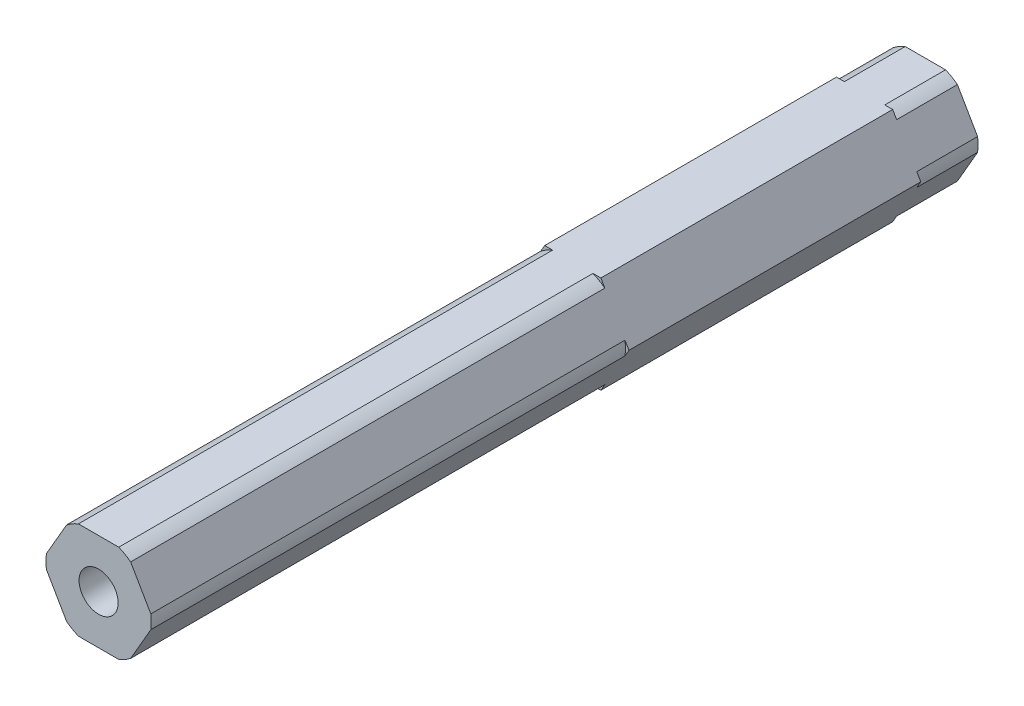
ISO-10303-21;
HEADER;
FILE_DESCRIPTION(('STEP AP214'),'2;1');
FILE_NAME('part.step','',(''),(''),'','','');
FILE_SCHEMA(('AUTOMOTIVE_DESIGN { 1 0 10303 214 1 1 1 1 }'));
ENDSEC;
DATA;
#1=APPLICATION_CONTEXT('core data for automotive mechanical design processes');
#2=APPLICATION_PROTOCOL_DEFINITION('international standard','automotive_design',2000,#1);
#3=PRODUCT_CONTEXT('',#1,'mechanical');
#4=PRODUCT('Part','Part','',(#3));
#5=PRODUCT_RELATED_PRODUCT_CATEGORY('part','',(#4));
#6=PRODUCT_DEFINITION_FORMATION('','',#4);
#7=PRODUCT_DEFINITION_CONTEXT('part definition',#1,'design');
#8=PRODUCT_DEFINITION('design','',#6,#7);
#9=PRODUCT_DEFINITION_SHAPE('','',#8);
#10=(LENGTH_UNIT() NAMED_UNIT(*) SI_UNIT(.MILLI.,.METRE.));
#11=(NAMED_UNIT(*) PLANE_ANGLE_UNIT() SI_UNIT($,.RADIAN.));
#12=(NAMED_UNIT(*) SI_UNIT($,.STERADIAN.) SOLID_ANGLE_UNIT());
#13=UNCERTAINTY_MEASURE_WITH_UNIT(LENGTH_MEASURE(1.E-05),#10,'distance_accuracy_value','');
#14=(GEOMETRIC_REPRESENTATION_CONTEXT(3) GLOBAL_UNCERTAINTY_ASSIGNED_CONTEXT((#13)) GLOBAL_UNIT_ASSIGNED_CONTEXT((#10,
#11,#12)) REPRESENTATION_CONTEXT('',''));
#15=CARTESIAN_POINT('',(0.,0.,0.));
#16=DIRECTION('',(0.,0.,1.));
#17=DIRECTION('',(1.,0.,0.));
#18=AXIS2_PLACEMENT_3D('',#15,#16,#17);
#19=CARTESIAN_POINT('',(0.,0.,-19.05));
#20=DIRECTION('',(0.,0.,1.));
#21=DIRECTION('',(1.,0.,0.));
#22=AXIS2_PLACEMENT_3D('',#19,#20,#21);
#23=PLANE('',#22);
#24=DIRECTION('',(-0.500000000000007,0.866025403784434,0.));
#25=VECTOR('',#24,1.);
#26=CARTESIAN_POINT('',(7.33234841870825,0.,-19.05));
#27=LINE('',#26,#25);
#28=CARTESIAN_POINT('',(4.18177080173133,5.45696050579325,-19.05));
#29=VERTEX_POINT('',#28);
#30=CARTESIAN_POINT('',(3.66617420935407,6.35000000000003,-19.05));
#31=VERTEX_POINT('',#30);
#32=EDGE_CURVE('E464',#29,#31,#27,.T.);
#33=ORIENTED_EDGE('',*,*,#32,.F.);
#34=CARTESIAN_POINT('',(0.,0.,-19.05));
#35=DIRECTION('',(0.,0.,1.));
#36=DIRECTION('',(1.,0.,0.));
#37=AXIS2_PLACEMENT_3D('',#34,#35,#36);
#38=CIRCLE('',#37,6.875);
#39=CARTESIAN_POINT('',(2.63498102459953,6.35000000000003,-19.05));
#40=VERTEX_POINT('',#39);
#41=EDGE_CURVE('E302',#29,#40,#38,.T.);
#42=ORIENTED_EDGE('',*,*,#41,.T.);
#43=DIRECTION('',(-1.,0.,0.));
#44=VECTOR('',#43,1.);
#45=CARTESIAN_POINT('',(3.66617420935407,6.35000000000003,-19.05));
#46=LINE('',#45,#44);
#47=EDGE_CURVE('E469',#31,#40,#46,.T.);
#48=ORIENTED_EDGE('',*,*,#47,.F.);
#49=EDGE_LOOP('',(#33,#42,#48));
#50=FACE_BOUND('',#49,.T.);
#51=ADVANCED_FACE('F37',(#50),#23,.F.);
#52=CARTESIAN_POINT('',(-2.63498102459953,6.35000000000003,-19.05));
#53=VERTEX_POINT('',#52);
#54=CARTESIAN_POINT('',(-3.6661742093542,6.34999999999996,-19.05));
#55=VERTEX_POINT('',#54);
#56=EDGE_CURVE('E468',#53,#55,#46,.T.);
#57=ORIENTED_EDGE('',*,*,#56,.F.);
#58=CARTESIAN_POINT('',(0.,0.,-19.05));
#59=DIRECTION('',(0.,0.,1.));
#60=DIRECTION('',(1.,0.,0.));
#61=AXIS2_PLACEMENT_3D('',#58,#59,#60);
#62=CIRCLE('',#61,6.875);
#63=CARTESIAN_POINT('',(-4.18177080173146,5.45696050579315,-19.05));
#64=VERTEX_POINT('',#63);
#65=EDGE_CURVE('E307',#53,#64,#62,.T.);
#66=ORIENTED_EDGE('',*,*,#65,.T.);
#67=DIRECTION('',(-0.499999999999995,-0.866025403784442,0.));
#68=VECTOR('',#67,1.);
#69=CARTESIAN_POINT('',(-3.6661742093542,6.34999999999996,-19.05));
#70=LINE('',#69,#68);
#71=EDGE_CURVE('E449',#55,#64,#70,.T.);
#72=ORIENTED_EDGE('',*,*,#71,.F.);
#73=EDGE_LOOP('',(#57,#66,#72));
#74=FACE_BOUND('',#73,.T.);
#75=ADVANCED_FACE('F535',(#74),#23,.F.);
#76=CARTESIAN_POINT('',(-6.81675182633099,0.893039494206808,-19.05));
#77=VERTEX_POINT('',#76);
#78=CARTESIAN_POINT('',(-7.33234841870825,0.,-19.05));
#79=VERTEX_POINT('',#78);
#80=EDGE_CURVE('E429',#77,#79,#70,.T.);
#81=ORIENTED_EDGE('',*,*,#80,.F.);
#82=CARTESIAN_POINT('',(0.,0.,-19.05));
#83=DIRECTION('',(0.,0.,1.));
#84=DIRECTION('',(1.,0.,0.));
#85=AXIS2_PLACEMENT_3D('',#82,#83,#84);
#86=CIRCLE('',#85,6.875);
#87=CARTESIAN_POINT('',(-6.81675182633099,-0.893039494206791,-19.05));
#88=VERTEX_POINT('',#87);
#89=EDGE_CURVE('E350',#77,#88,#86,.T.);
#90=ORIENTED_EDGE('',*,*,#89,.T.);
#91=DIRECTION('',(0.500000000000001,-0.866025403784438,0.));
#92=VECTOR('',#91,1.);
#93=CARTESIAN_POINT('',(-7.33234841870825,0.,-19.05));
#94=LINE('',#93,#92);
#95=EDGE_CURVE('E453',#79,#88,#94,.T.);
#96=ORIENTED_EDGE('',*,*,#95,.F.);
#97=EDGE_LOOP('',(#81,#90,#96));
#98=FACE_BOUND('',#97,.T.);
#99=ADVANCED_FACE('F529',(#98),#23,.F.);
#100=CARTESIAN_POINT('',(-4.18177080173137,-5.45696050579322,-19.05));
#101=VERTEX_POINT('',#100);
#102=CARTESIAN_POINT('',(-3.66617420935411,-6.35000000000001,-19.05));
#103=VERTEX_POINT('',#102);
#104=EDGE_CURVE('E452',#101,#103,#94,.T.);
#105=ORIENTED_EDGE('',*,*,#104,.F.);
#106=CARTESIAN_POINT('',(0.,0.,-19.05));
#107=DIRECTION('',(0.,0.,1.));
#108=DIRECTION('',(1.,0.,0.));
#109=AXIS2_PLACEMENT_3D('',#106,#107,#108);
#110=CIRCLE('',#109,6.875);
#111=CARTESIAN_POINT('',(-2.63498102459959,-6.35000000000001,-19.05));
#112=VERTEX_POINT('',#111);
#113=EDGE_CURVE('E347',#101,#112,#110,.T.);
#114=ORIENTED_EDGE('',*,*,#113,.T.);
#115=DIRECTION('',(1.,0.,0.));
#116=VECTOR('',#115,1.);
#117=CARTESIAN_POINT('',(-3.66617420935411,-6.35000000000001,-19.05));
#118=LINE('',#117,#116);
#119=EDGE_CURVE('E457',#103,#112,#118,.T.);
#120=ORIENTED_EDGE('',*,*,#119,.F.);
#121=EDGE_LOOP('',(#105,#114,#120));
#122=FACE_BOUND('',#121,.T.);
#123=ADVANCED_FACE('F492',(#122),#23,.F.);
#124=CARTESIAN_POINT('',(2.63498102459964,-6.34999999999999,-19.05));
#125=VERTEX_POINT('',#124);
#126=CARTESIAN_POINT('',(3.66617420935415,-6.34999999999998,-19.05));
#127=VERTEX_POINT('',#126);
#128=EDGE_CURVE('E456',#125,#127,#118,.T.);
#129=ORIENTED_EDGE('',*,*,#128,.F.);
#130=CARTESIAN_POINT('',(0.,0.,-19.05));
#131=DIRECTION('',(0.,0.,1.));
#132=DIRECTION('',(1.,0.,0.));
#133=AXIS2_PLACEMENT_3D('',#130,#131,#132);
#134=CIRCLE('',#133,6.875);
#135=CARTESIAN_POINT('',(4.1817708017314,-5.45696050579319,-19.05));
#136=VERTEX_POINT('',#135);
#137=EDGE_CURVE('E344',#125,#136,#134,.T.);
#138=ORIENTED_EDGE('',*,*,#137,.T.);
#139=DIRECTION('',(0.499999999999995,0.866025403784442,0.));
#140=VECTOR('',#139,1.);
#141=CARTESIAN_POINT('',(3.66617420935415,-6.34999999999998,-19.05));
#142=LINE('',#141,#140);
#143=EDGE_CURVE('E461',#127,#136,#142,.T.);
#144=ORIENTED_EDGE('',*,*,#143,.F.);
#145=EDGE_LOOP('',(#129,#138,#144));
#146=FACE_BOUND('',#145,.T.);
#147=ADVANCED_FACE('F516',(#146),#23,.F.);
#148=CARTESIAN_POINT('',(0.,0.,19.05));
#149=DIRECTION('',(0.,0.,1.));
#150=DIRECTION('',(1.,0.,0.));
#151=AXIS2_PLACEMENT_3D('',#148,#149,#150);
#152=PLANE('',#151);
#153=CARTESIAN_POINT('',(0.,0.,19.05));
#154=DIRECTION('',(0.,0.,1.));
#155=DIRECTION('',(1.,0.,0.));
#156=AXIS2_PLACEMENT_3D('',#153,#154,#155);
#157=CIRCLE('',#156,6.875);
#158=CARTESIAN_POINT('',(4.18177080173133,5.45696050579325,19.05));
#159=VERTEX_POINT('',#158);
#160=CARTESIAN_POINT('',(2.63498102459955,6.35000000000002,19.05));
#161=VERTEX_POINT('',#160);
#162=EDGE_CURVE('E377',#159,#161,#157,.T.);
#163=ORIENTED_EDGE('',*,*,#162,.F.);
#164=DIRECTION('',(-0.500000000000007,0.866025403784434,0.));
#165=VECTOR('',#164,1.);
#166=CARTESIAN_POINT('',(7.33234841870825,0.,19.05));
#167=LINE('',#166,#165);
#168=CARTESIAN_POINT('',(3.66617420935407,6.35000000000003,19.05));
#169=VERTEX_POINT('',#168);
#170=EDGE_CURVE('E442',#159,#169,#167,.T.);
#171=ORIENTED_EDGE('',*,*,#170,.T.);
#172=DIRECTION('',(-1.,0.,0.));
#173=VECTOR('',#172,1.);
#174=CARTESIAN_POINT('',(3.66617420935407,6.35000000000003,19.05));
#175=LINE('',#174,#173);
#176=EDGE_CURVE('E446',#169,#161,#175,.T.);
#177=ORIENTED_EDGE('',*,*,#176,.T.);
#178=EDGE_LOOP('',(#163,#171,#177));
#179=FACE_BOUND('',#178,.T.);
#180=ADVANCED_FACE('F518',(#179),#152,.T.);
#181=CARTESIAN_POINT('',(0.,0.,19.05));
#182=DIRECTION('',(0.,0.,1.));
#183=DIRECTION('',(1.,0.,0.));
#184=AXIS2_PLACEMENT_3D('',#181,#182,#183);
#185=CIRCLE('',#184,6.875);
#186=CARTESIAN_POINT('',(6.816751826331,-0.893039494206742,19.05));
#187=VERTEX_POINT('',#186);
#188=CARTESIAN_POINT('',(6.81675182633098,0.893039494206836,19.05));
#189=VERTEX_POINT('',#188);
#190=EDGE_CURVE('E390',#187,#189,#185,.T.);
#191=ORIENTED_EDGE('',*,*,#190,.F.);
#192=DIRECTION('',(0.499999999999995,0.866025403784442,0.));
#193=VECTOR('',#192,1.);
#194=CARTESIAN_POINT('',(3.66617420935415,-6.34999999999998,19.05));
#195=LINE('',#194,#193);
#196=CARTESIAN_POINT('',(7.33234841870825,0.,19.05));
#197=VERTEX_POINT('',#196);
#198=EDGE_CURVE('E439',#187,#197,#195,.T.);
#199=ORIENTED_EDGE('',*,*,#198,.T.);
#200=EDGE_CURVE('E443',#197,#189,#167,.T.);
#201=ORIENTED_EDGE('',*,*,#200,.T.);
#202=EDGE_LOOP('',(#191,#199,#201));
#203=FACE_BOUND('',#202,.T.);
#204=ADVANCED_FACE('F525',(#203),#152,.T.);
#205=CARTESIAN_POINT('',(0.,0.,19.05));
#206=DIRECTION('',(0.,0.,1.));
#207=DIRECTION('',(1.,0.,0.));
#208=AXIS2_PLACEMENT_3D('',#205,#206,#207);
#209=CIRCLE('',#208,6.875);
#210=CARTESIAN_POINT('',(2.63498102459964,-6.34999999999999,19.05));
#211=VERTEX_POINT('',#210);
#212=CARTESIAN_POINT('',(4.18177080173141,-5.45696050579319,19.05));
#213=VERTEX_POINT('',#212);
#214=EDGE_CURVE('E387',#211,#213,#209,.T.);
#215=ORIENTED_EDGE('',*,*,#214,.F.);
#216=DIRECTION('',(1.,0.,0.));
#217=VECTOR('',#216,1.);
#218=CARTESIAN_POINT('',(-3.66617420935411,-6.35000000000001,19.05));
#219=LINE('',#218,#217);
#220=CARTESIAN_POINT('',(3.66617420935415,-6.34999999999998,19.05));
#221=VERTEX_POINT('',#220);
#222=EDGE_CURVE('E436',#211,#221,#219,.T.);
#223=ORIENTED_EDGE('',*,*,#222,.T.);
#224=EDGE_CURVE('E440',#221,#213,#195,.T.);
#225=ORIENTED_EDGE('',*,*,#224,.T.);
#226=EDGE_LOOP('',(#215,#223,#225));
#227=FACE_BOUND('',#226,.T.);
#228=ADVANCED_FACE('F602',(#227),#152,.T.);
#229=CARTESIAN_POINT('',(0.,0.,19.05));
#230=DIRECTION('',(0.,0.,1.));
#231=DIRECTION('',(1.,0.,0.));
#232=AXIS2_PLACEMENT_3D('',#229,#230,#231);
#233=CIRCLE('',#232,6.875);
#234=CARTESIAN_POINT('',(-4.18177080173137,-5.45696050579322,19.05));
#235=VERTEX_POINT('',#234);
#236=CARTESIAN_POINT('',(-2.63498102459959,-6.35000000000001,19.05));
#237=VERTEX_POINT('',#236);
#238=EDGE_CURVE('E384',#235,#237,#233,.T.);
#239=ORIENTED_EDGE('',*,*,#238,.F.);
#240=DIRECTION('',(0.500000000000001,-0.866025403784438,0.));
#241=VECTOR('',#240,1.);
#242=CARTESIAN_POINT('',(-7.33234841870825,0.,19.05));
#243=LINE('',#242,#241);
#244=CARTESIAN_POINT('',(-3.66617420935411,-6.35000000000001,19.05));
#245=VERTEX_POINT('',#244);
#246=EDGE_CURVE('E432',#235,#245,#243,.T.);
#247=ORIENTED_EDGE('',*,*,#246,.T.);
#248=EDGE_CURVE('E437',#245,#237,#219,.T.);
#249=ORIENTED_EDGE('',*,*,#248,.T.);
#250=EDGE_LOOP('',(#239,#247,#249));
#251=FACE_BOUND('',#250,.T.);
#252=ADVANCED_FACE('F604',(#251),#152,.T.);
#253=CARTESIAN_POINT('',(0.,0.,19.05));
#254=DIRECTION('',(0.,0.,1.));
#255=DIRECTION('',(1.,0.,0.));
#256=AXIS2_PLACEMENT_3D('',#253,#254,#255);
#257=CIRCLE('',#256,6.875);
#258=CARTESIAN_POINT('',(-6.81675182633099,0.893039494206809,19.05));
#259=VERTEX_POINT('',#258);
#260=CARTESIAN_POINT('',(-6.81675182633099,-0.893039494206789,19.05));
#261=VERTEX_POINT('',#260);
#262=EDGE_CURVE('E381',#259,#261,#257,.T.);
#263=ORIENTED_EDGE('',*,*,#262,.F.);
#264=DIRECTION('',(-0.499999999999995,-0.866025403784442,0.));
#265=VECTOR('',#264,1.);
#266=CARTESIAN_POINT('',(-3.6661742093542,6.34999999999996,19.05));
#267=LINE('',#266,#265);
#268=CARTESIAN_POINT('',(-7.33234841870825,0.,19.05));
#269=VERTEX_POINT('',#268);
#270=EDGE_CURVE('E433',#259,#269,#267,.T.);
#271=ORIENTED_EDGE('',*,*,#270,.T.);
#272=EDGE_CURVE('E434',#269,#261,#243,.T.);
#273=ORIENTED_EDGE('',*,*,#272,.T.);
#274=EDGE_LOOP('',(#263,#271,#273));
#275=FACE_BOUND('',#274,.T.);
#276=ADVANCED_FACE('F609',(#275),#152,.T.);
#277=CARTESIAN_POINT('',(-3.6661742093542,6.34999999999996,19.05));
#278=DIRECTION('',(0.866025403784442,-0.499999999999995,0.));
#279=DIRECTION('',(0.499999999999995,0.866025403784442,0.));
#280=AXIS2_PLACEMENT_3D('',#277,#278,#279);
#281=PLANE('',#280);
#282=ORIENTED_EDGE('',*,*,#71,.T.);
#283=DIRECTION('',(0.,0.,1.));
#284=VECTOR('',#283,1.);
#285=CARTESIAN_POINT('',(-4.18177080173146,5.45696050579315,-26.9875));
#286=LINE('',#285,#284);
#287=CARTESIAN_POINT('',(-4.18177080173146,5.45696050579315,-26.9875));
#288=VERTEX_POINT('',#287);
#289=EDGE_CURVE('E358',#288,#64,#286,.T.);
#290=ORIENTED_EDGE('',*,*,#289,.F.);
#291=DIRECTION('',(-0.499999999999995,-0.866025403784442,0.));
#292=VECTOR('',#291,1.);
#293=CARTESIAN_POINT('',(-4.18177080173146,5.45696050579315,-26.9875));
#294=LINE('',#293,#292);
#295=CARTESIAN_POINT('',(-6.81675182633099,0.893039494206808,-26.9875));
#296=VERTEX_POINT('',#295);
#297=EDGE_CURVE('E330',#288,#296,#294,.T.);
#298=ORIENTED_EDGE('',*,*,#297,.T.);
#299=DIRECTION('',(0.,0.,1.));
#300=VECTOR('',#299,1.);
#301=CARTESIAN_POINT('',(-6.81675182633099,0.893039494206808,-26.9875));
#302=LINE('',#301,#300);
#303=EDGE_CURVE('E360',#296,#77,#302,.T.);
#304=ORIENTED_EDGE('',*,*,#303,.T.);
#305=ORIENTED_EDGE('',*,*,#80,.T.);
#306=DIRECTION('',(0.,0.,-1.));
#307=VECTOR('',#306,1.);
#308=CARTESIAN_POINT('',(-7.33234841870825,0.,19.05));
#309=LINE('',#308,#307);
#310=EDGE_CURVE('E11',#269,#79,#309,.T.);
#311=ORIENTED_EDGE('',*,*,#310,.F.);
#312=ORIENTED_EDGE('',*,*,#270,.F.);
#313=DIRECTION('',(0.,0.,-1.));
#314=VECTOR('',#313,1.);
#315=CARTESIAN_POINT('',(-6.81675182633099,0.893039494206808,26.9875));
#316=LINE('',#315,#314);
#317=CARTESIAN_POINT('',(-6.81675182633099,0.893039494206808,80.9625));
#318=VERTEX_POINT('',#317);
#319=EDGE_CURVE('E417',#318,#259,#316,.T.);
#320=ORIENTED_EDGE('',*,*,#319,.F.);
#321=DIRECTION('',(-0.499999999999995,-0.866025403784442,0.));
#322=VECTOR('',#321,1.);
#323=CARTESIAN_POINT('',(-4.18177080173146,5.45696050579315,80.9625));
#324=LINE('',#323,#322);
#325=CARTESIAN_POINT('',(-4.18177080173146,5.45696050579315,80.9625));
#326=VERTEX_POINT('',#325);
#327=EDGE_CURVE('E275',#326,#318,#324,.T.);
#328=ORIENTED_EDGE('',*,*,#327,.F.);
#329=DIRECTION('',(0.,0.,-1.));
#330=VECTOR('',#329,1.);
#331=CARTESIAN_POINT('',(-4.18177080173146,5.45696050579315,26.9875));
#332=LINE('',#331,#330);
#333=CARTESIAN_POINT('',(-4.18177080173146,5.45696050579315,19.05));
#334=VERTEX_POINT('',#333);
#335=EDGE_CURVE('E420',#326,#334,#332,.T.);
#336=ORIENTED_EDGE('',*,*,#335,.T.);
#337=CARTESIAN_POINT('',(-3.6661742093542,6.34999999999996,19.05));
#338=VERTEX_POINT('',#337);
#339=EDGE_CURVE('E430',#338,#334,#267,.T.);
#340=ORIENTED_EDGE('',*,*,#339,.F.);
#341=DIRECTION('',(0.,0.,-1.));
#342=VECTOR('',#341,1.);
#343=CARTESIAN_POINT('',(-3.6661742093542,6.34999999999996,19.05));
#344=LINE('',#343,#342);
#345=EDGE_CURVE('E448',#338,#55,#344,.T.);
#346=ORIENTED_EDGE('',*,*,#345,.T.);
#347=EDGE_LOOP('',(#282,#290,#298,#304,#305,#311,#312,#320,#328,#336,#340,#346));
#348=FACE_BOUND('',#347,.T.);
#349=ADVANCED_FACE('F39',(#348),#281,.F.);
#350=CARTESIAN_POINT('',(-7.33234841870825,0.,19.05));
#351=DIRECTION('',(0.866025403784438,0.500000000000001,0.));
#352=DIRECTION('',(-0.500000000000001,0.866025403784438,0.));
#353=AXIS2_PLACEMENT_3D('',#350,#351,#352);
#354=PLANE('',#353);
#355=ORIENTED_EDGE('',*,*,#95,.T.);
#356=DIRECTION('',(0.,0.,1.));
#357=VECTOR('',#356,1.);
#358=CARTESIAN_POINT('',(-6.81675182633099,-0.893039494206791,-26.9875));
#359=LINE('',#358,#357);
#360=CARTESIAN_POINT('',(-6.81675182633099,-0.893039494206791,-26.9875));
#361=VERTEX_POINT('',#360);
#362=EDGE_CURVE('E362',#361,#88,#359,.T.);
#363=ORIENTED_EDGE('',*,*,#362,.F.);
#364=DIRECTION('',(0.500000000000001,-0.866025403784438,0.));
#365=VECTOR('',#364,1.);
#366=CARTESIAN_POINT('',(-6.81675182633099,-0.893039494206791,-26.9875));
#367=LINE('',#366,#365);
#368=CARTESIAN_POINT('',(-4.18177080173137,-5.45696050579322,-26.9875));
#369=VERTEX_POINT('',#368);
#370=EDGE_CURVE('E324',#361,#369,#367,.T.);
#371=ORIENTED_EDGE('',*,*,#370,.T.);
#372=DIRECTION('',(0.,0.,1.));
#373=VECTOR('',#372,1.);
#374=CARTESIAN_POINT('',(-4.18177080173137,-5.45696050579322,-26.9875));
#375=LINE('',#374,#373);
#376=EDGE_CURVE('E364',#369,#101,#375,.T.);
#377=ORIENTED_EDGE('',*,*,#376,.T.);
#378=ORIENTED_EDGE('',*,*,#104,.T.);
#379=DIRECTION('',(0.,0.,-1.));
#380=VECTOR('',#379,1.);
#381=CARTESIAN_POINT('',(-3.66617420935411,-6.35000000000001,19.05));
#382=LINE('',#381,#380);
#383=EDGE_CURVE('E45',#245,#103,#382,.T.);
#384=ORIENTED_EDGE('',*,*,#383,.F.);
#385=ORIENTED_EDGE('',*,*,#246,.F.);
#386=DIRECTION('',(0.,0.,-1.));
#387=VECTOR('',#386,1.);
#388=CARTESIAN_POINT('',(-4.18177080173137,-5.45696050579322,26.9875));
#389=LINE('',#388,#387);
#390=CARTESIAN_POINT('',(-4.18177080173137,-5.45696050579322,80.9625));
#391=VERTEX_POINT('',#390);
#392=EDGE_CURVE('E411',#391,#235,#389,.T.);
#393=ORIENTED_EDGE('',*,*,#392,.F.);
#394=DIRECTION('',(0.500000000000001,-0.866025403784438,0.));
#395=VECTOR('',#394,1.);
#396=CARTESIAN_POINT('',(-6.81675182633099,-0.893039494206791,80.9625));
#397=LINE('',#396,#395);
#398=CARTESIAN_POINT('',(-6.81675182633099,-0.893039494206791,80.9625));
#399=VERTEX_POINT('',#398);
#400=EDGE_CURVE('E281',#399,#391,#397,.T.);
#401=ORIENTED_EDGE('',*,*,#400,.F.);
#402=DIRECTION('',(0.,0.,-1.));
#403=VECTOR('',#402,1.);
#404=CARTESIAN_POINT('',(-6.81675182633099,-0.893039494206791,26.9875));
#405=LINE('',#404,#403);
#406=EDGE_CURVE('E414',#399,#261,#405,.T.);
#407=ORIENTED_EDGE('',*,*,#406,.T.);
#408=ORIENTED_EDGE('',*,*,#272,.F.);
#409=ORIENTED_EDGE('',*,*,#310,.T.);
#410=EDGE_LOOP('',(#355,#363,#371,#377,#378,#384,#385,#393,#401,#407,#408,#409));
#411=FACE_BOUND('',#410,.T.);
#412=ADVANCED_FACE('F593',(#411),#354,.F.);
#413=CARTESIAN_POINT('',(-3.66617420935411,-6.35000000000001,19.05));
#414=DIRECTION('',(0.,1.,0.));
#415=DIRECTION('',(-1.,0.,0.));
#416=AXIS2_PLACEMENT_3D('',#413,#414,#415);
#417=PLANE('',#416);
#418=ORIENTED_EDGE('',*,*,#119,.T.);
#419=DIRECTION('',(0.,0.,1.));
#420=VECTOR('',#419,1.);
#421=CARTESIAN_POINT('',(-2.63498102459959,-6.35000000000001,-26.9875));
#422=LINE('',#421,#420);
#423=CARTESIAN_POINT('',(-2.63498102459959,-6.35000000000001,-26.9875));
#424=VERTEX_POINT('',#423);
#425=EDGE_CURVE('E366',#424,#112,#422,.T.);
#426=ORIENTED_EDGE('',*,*,#425,.F.);
#427=DIRECTION('',(1.,0.,0.));
#428=VECTOR('',#427,1.);
#429=CARTESIAN_POINT('',(-2.63498102459959,-6.35000000000001,-26.9875));
#430=LINE('',#429,#428);
#431=CARTESIAN_POINT('',(2.63498102459964,-6.34999999999999,-26.9875));
#432=VERTEX_POINT('',#431);
#433=EDGE_CURVE('E318',#424,#432,#430,.T.);
#434=ORIENTED_EDGE('',*,*,#433,.T.);
#435=DIRECTION('',(0.,0.,1.));
#436=VECTOR('',#435,1.);
#437=CARTESIAN_POINT('',(2.63498102459964,-6.34999999999999,-26.9875));
#438=LINE('',#437,#436);
#439=EDGE_CURVE('E368',#432,#125,#438,.T.);
#440=ORIENTED_EDGE('',*,*,#439,.T.);
#441=ORIENTED_EDGE('',*,*,#128,.T.);
#442=DIRECTION('',(0.,0.,-1.));
#443=VECTOR('',#442,1.);
#444=CARTESIAN_POINT('',(3.66617420935415,-6.34999999999998,19.05));
#445=LINE('',#444,#443);
#446=EDGE_CURVE('E480',#221,#127,#445,.T.);
#447=ORIENTED_EDGE('',*,*,#446,.F.);
#448=ORIENTED_EDGE('',*,*,#222,.F.);
#449=DIRECTION('',(0.,0.,-1.));
#450=VECTOR('',#449,1.);
#451=CARTESIAN_POINT('',(2.63498102459964,-6.34999999999999,26.9875));
#452=LINE('',#451,#450);
#453=CARTESIAN_POINT('',(2.63498102459964,-6.34999999999999,80.9625));
#454=VERTEX_POINT('',#453);
#455=EDGE_CURVE('E405',#454,#211,#452,.T.);
#456=ORIENTED_EDGE('',*,*,#455,.F.);
#457=DIRECTION('',(1.,0.,0.));
#458=VECTOR('',#457,1.);
#459=CARTESIAN_POINT('',(-2.63498102459959,-6.35000000000001,80.9625));
#460=LINE('',#459,#458);
#461=CARTESIAN_POINT('',(-2.63498102459959,-6.35000000000001,80.9625));
#462=VERTEX_POINT('',#461);
#463=EDGE_CURVE('E287',#462,#454,#460,.T.);
#464=ORIENTED_EDGE('',*,*,#463,.F.);
#465=DIRECTION('',(0.,0.,-1.));
#466=VECTOR('',#465,1.);
#467=CARTESIAN_POINT('',(-2.63498102459959,-6.35000000000001,26.9875));
#468=LINE('',#467,#466);
#469=EDGE_CURVE('E408',#462,#237,#468,.T.);
#470=ORIENTED_EDGE('',*,*,#469,.T.);
#471=ORIENTED_EDGE('',*,*,#248,.F.);
#472=ORIENTED_EDGE('',*,*,#383,.T.);
#473=EDGE_LOOP('',(#418,#426,#434,#440,#441,#447,#448,#456,#464,#470,#471,#472));
#474=FACE_BOUND('',#473,.T.);
#475=ADVANCED_FACE('F487',(#474),#417,.F.);
#476=CARTESIAN_POINT('',(3.66617420935415,-6.34999999999998,19.05));
#477=DIRECTION('',(-0.866025403784442,0.499999999999995,0.));
#478=DIRECTION('',(-0.499999999999995,-0.866025403784442,0.));
#479=AXIS2_PLACEMENT_3D('',#476,#477,#478);
#480=PLANE('',#479);
#481=ORIENTED_EDGE('',*,*,#143,.T.);
#482=DIRECTION('',(0.,0.,1.));
#483=VECTOR('',#482,1.);
#484=CARTESIAN_POINT('',(4.1817708017314,-5.45696050579319,-26.9875));
#485=LINE('',#484,#483);
#486=CARTESIAN_POINT('',(4.1817708017314,-5.45696050579319,-26.9875));
#487=VERTEX_POINT('',#486);
#488=EDGE_CURVE('E370',#487,#136,#485,.T.);
#489=ORIENTED_EDGE('',*,*,#488,.F.);
#490=DIRECTION('',(0.499999999999995,0.866025403784441,0.));
#491=VECTOR('',#490,1.);
#492=CARTESIAN_POINT('',(4.1817708017314,-5.45696050579319,-26.9875));
#493=LINE('',#492,#491);
#494=CARTESIAN_POINT('',(6.816751826331,-0.893039494206739,-26.9875));
#495=VERTEX_POINT('',#494);
#496=EDGE_CURVE('E312',#487,#495,#493,.T.);
#497=ORIENTED_EDGE('',*,*,#496,.T.);
#498=DIRECTION('',(0.,0.,1.));
#499=VECTOR('',#498,1.);
#500=CARTESIAN_POINT('',(6.816751826331,-0.893039494206739,-26.9875));
#501=LINE('',#500,#499);
#502=CARTESIAN_POINT('',(6.816751826331,-0.893039494206739,-19.05));
#503=VERTEX_POINT('',#502);
#504=EDGE_CURVE('E372',#495,#503,#501,.T.);
#505=ORIENTED_EDGE('',*,*,#504,.T.);
#506=CARTESIAN_POINT('',(7.33234841870825,0.,-19.05));
#507=VERTEX_POINT('',#506);
#508=EDGE_CURVE('E460',#503,#507,#142,.T.);
#509=ORIENTED_EDGE('',*,*,#508,.T.);
#510=DIRECTION('',(0.,0.,-1.));
#511=VECTOR('',#510,1.);
#512=CARTESIAN_POINT('',(7.33234841870825,0.,19.05));
#513=LINE('',#512,#511);
#514=EDGE_CURVE('E477',#197,#507,#513,.T.);
#515=ORIENTED_EDGE('',*,*,#514,.F.);
#516=ORIENTED_EDGE('',*,*,#198,.F.);
#517=DIRECTION('',(0.,0.,-1.));
#518=VECTOR('',#517,1.);
#519=CARTESIAN_POINT('',(6.816751826331,-0.893039494206739,26.9875));
#520=LINE('',#519,#518);
#521=CARTESIAN_POINT('',(6.816751826331,-0.893039494206739,80.9625));
#522=VERTEX_POINT('',#521);
#523=EDGE_CURVE('E399',#522,#187,#520,.T.);
#524=ORIENTED_EDGE('',*,*,#523,.F.);
#525=DIRECTION('',(0.499999999999995,0.866025403784442,0.));
#526=VECTOR('',#525,1.);
#527=CARTESIAN_POINT('',(4.18177080173141,-5.45696050579319,80.9625));
#528=LINE('',#527,#526);
#529=CARTESIAN_POINT('',(4.18177080173141,-5.45696050579319,80.9625));
#530=VERTEX_POINT('',#529);
#531=EDGE_CURVE('E293',#530,#522,#528,.T.);
#532=ORIENTED_EDGE('',*,*,#531,.F.);
#533=DIRECTION('',(0.,0.,-1.));
#534=VECTOR('',#533,1.);
#535=CARTESIAN_POINT('',(4.1817708017314,-5.45696050579319,26.9875));
#536=LINE('',#535,#534);
#537=EDGE_CURVE('E402',#530,#213,#536,.T.);
#538=ORIENTED_EDGE('',*,*,#537,.T.);
#539=ORIENTED_EDGE('',*,*,#224,.F.);
#540=ORIENTED_EDGE('',*,*,#446,.T.);
#541=EDGE_LOOP('',(#481,#489,#497,#505,#509,#515,#516,#524,#532,#538,#539,#540));
#542=FACE_BOUND('',#541,.T.);
#543=ADVANCED_FACE('F515',(#542),#480,.F.);
#544=CARTESIAN_POINT('',(7.33234841870825,0.,19.05));
#545=DIRECTION('',(-0.866025403784435,-0.500000000000007,0.));
#546=DIRECTION('',(0.500000000000007,-0.866025403784434,0.));
#547=AXIS2_PLACEMENT_3D('',#544,#545,#546);
#548=PLANE('',#547);
#549=CARTESIAN_POINT('',(6.81675182633098,0.893039494206836,-19.05));
#550=VERTEX_POINT('',#549);
#551=EDGE_CURVE('E465',#507,#550,#27,.T.);
#552=ORIENTED_EDGE('',*,*,#551,.T.);
#553=DIRECTION('',(0.,0.,1.));
#554=VECTOR('',#553,1.);
#555=CARTESIAN_POINT('',(6.81675182633098,0.893039494206839,-26.9875));
#556=LINE('',#555,#554);
#557=CARTESIAN_POINT('',(6.81675182633098,0.893039494206839,-26.9875));
#558=VERTEX_POINT('',#557);
#559=EDGE_CURVE('E52',#558,#550,#556,.T.);
#560=ORIENTED_EDGE('',*,*,#559,.F.);
#561=DIRECTION('',(-0.500000000000007,0.866025403784435,0.));
#562=VECTOR('',#561,1.);
#563=CARTESIAN_POINT('',(6.81675182633098,0.893039494206839,-26.9875));
#564=LINE('',#563,#562);
#565=CARTESIAN_POINT('',(4.18177080173133,5.45696050579325,-26.9875));
#566=VERTEX_POINT('',#565);
#567=EDGE_CURVE('E306',#558,#566,#564,.T.);
#568=ORIENTED_EDGE('',*,*,#567,.T.);
#569=DIRECTION('',(0.,0.,1.));
#570=VECTOR('',#569,1.);
#571=CARTESIAN_POINT('',(4.18177080173133,5.45696050579325,-26.9875));
#572=LINE('',#571,#570);
#573=EDGE_CURVE('E375',#566,#29,#572,.T.);
#574=ORIENTED_EDGE('',*,*,#573,.T.);
#575=ORIENTED_EDGE('',*,*,#32,.T.);
#576=DIRECTION('',(0.,0.,-1.));
#577=VECTOR('',#576,1.);
#578=CARTESIAN_POINT('',(3.66617420935407,6.35000000000003,19.05));
#579=LINE('',#578,#577);
#580=EDGE_CURVE('E474',#169,#31,#579,.T.);
#581=ORIENTED_EDGE('',*,*,#580,.F.);
#582=ORIENTED_EDGE('',*,*,#170,.F.);
#583=DIRECTION('',(0.,0.,-1.));
#584=VECTOR('',#583,1.);
#585=CARTESIAN_POINT('',(4.18177080173133,5.45696050579325,26.9875));
#586=LINE('',#585,#584);
#587=CARTESIAN_POINT('',(4.18177080173133,5.45696050579325,80.9625));
#588=VERTEX_POINT('',#587);
#589=EDGE_CURVE('E393',#588,#159,#586,.T.);
#590=ORIENTED_EDGE('',*,*,#589,.F.);
#591=DIRECTION('',(-0.500000000000007,0.866025403784435,0.));
#592=VECTOR('',#591,1.);
#593=CARTESIAN_POINT('',(6.81675182633098,0.893039494206839,80.9625));
#594=LINE('',#593,#592);
#595=CARTESIAN_POINT('',(6.81675182633098,0.893039494206839,80.9625));
#596=VERTEX_POINT('',#595);
#597=EDGE_CURVE('E299',#596,#588,#594,.T.);
#598=ORIENTED_EDGE('',*,*,#597,.F.);
#599=DIRECTION('',(0.,0.,-1.));
#600=VECTOR('',#599,1.);
#601=CARTESIAN_POINT('',(6.81675182633098,0.893039494206839,26.9875));
#602=LINE('',#601,#600);
#603=EDGE_CURVE('E396',#596,#189,#602,.T.);
#604=ORIENTED_EDGE('',*,*,#603,.T.);
#605=ORIENTED_EDGE('',*,*,#200,.F.);
#606=ORIENTED_EDGE('',*,*,#514,.T.);
#607=EDGE_LOOP('',(#552,#560,#568,#574,#575,#581,#582,#590,#598,#604,#605,#606));
#608=FACE_BOUND('',#607,.T.);
#609=ADVANCED_FACE('F546',(#608),#548,.F.);
#610=CARTESIAN_POINT('',(3.66617420935407,6.35000000000003,19.05));
#611=DIRECTION('',(0.,-1.,0.));
#612=DIRECTION('',(1.,0.,0.));
#613=AXIS2_PLACEMENT_3D('',#610,#611,#612);
#614=PLANE('',#613);
#615=ORIENTED_EDGE('',*,*,#47,.T.);
#616=DIRECTION('',(0.,0.,1.));
#617=VECTOR('',#616,1.);
#618=CARTESIAN_POINT('',(2.63498102459953,6.35000000000003,-26.9875));
#619=LINE('',#618,#617);
#620=CARTESIAN_POINT('',(2.63498102459953,6.35000000000003,-26.9875));
#621=VERTEX_POINT('',#620);
#622=EDGE_CURVE('E339',#621,#40,#619,.T.);
#623=ORIENTED_EDGE('',*,*,#622,.F.);
#624=DIRECTION('',(-1.,0.,0.));
#625=VECTOR('',#624,1.);
#626=CARTESIAN_POINT('',(2.63498102459953,6.35000000000003,-26.9875));
#627=LINE('',#626,#625);
#628=CARTESIAN_POINT('',(-2.63498102459953,6.35000000000003,-26.9875));
#629=VERTEX_POINT('',#628);
#630=EDGE_CURVE('E336',#621,#629,#627,.T.);
#631=ORIENTED_EDGE('',*,*,#630,.T.);
#632=DIRECTION('',(0.,0.,1.));
#633=VECTOR('',#632,1.);
#634=CARTESIAN_POINT('',(-2.63498102459953,6.35000000000003,-26.9875));
#635=LINE('',#634,#633);
#636=EDGE_CURVE('E356',#629,#53,#635,.T.);
#637=ORIENTED_EDGE('',*,*,#636,.T.);
#638=ORIENTED_EDGE('',*,*,#56,.T.);
#639=ORIENTED_EDGE('',*,*,#345,.F.);
#640=CARTESIAN_POINT('',(-2.63498102459969,6.34999999999997,19.05));
#641=VERTEX_POINT('',#640);
#642=EDGE_CURVE('E445',#641,#338,#175,.T.);
#643=ORIENTED_EDGE('',*,*,#642,.F.);
#644=DIRECTION('',(0.,0.,-1.));
#645=VECTOR('',#644,1.);
#646=CARTESIAN_POINT('',(-2.63498102459953,6.35000000000003,26.9875));
#647=LINE('',#646,#645);
#648=CARTESIAN_POINT('',(-2.63498102459953,6.35000000000004,80.9625));
#649=VERTEX_POINT('',#648);
#650=EDGE_CURVE('E423',#649,#641,#647,.T.);
#651=ORIENTED_EDGE('',*,*,#650,.F.);
#652=DIRECTION('',(-1.,0.,0.));
#653=VECTOR('',#652,1.);
#654=CARTESIAN_POINT('',(2.63498102459953,6.35000000000003,80.9625));
#655=LINE('',#654,#653);
#656=CARTESIAN_POINT('',(2.63498102459953,6.35000000000003,80.9625));
#657=VERTEX_POINT('',#656);
#658=EDGE_CURVE('E269',#657,#649,#655,.T.);
#659=ORIENTED_EDGE('',*,*,#658,.F.);
#660=DIRECTION('',(0.,0.,-1.));
#661=VECTOR('',#660,1.);
#662=CARTESIAN_POINT('',(2.63498102459953,6.35000000000003,26.9875));
#663=LINE('',#662,#661);
#664=EDGE_CURVE('E426',#657,#161,#663,.T.);
#665=ORIENTED_EDGE('',*,*,#664,.T.);
#666=ORIENTED_EDGE('',*,*,#176,.F.);
#667=ORIENTED_EDGE('',*,*,#580,.T.);
#668=EDGE_LOOP('',(#615,#623,#631,#637,#638,#639,#643,#651,#659,#665,#666,#667));
#669=FACE_BOUND('',#668,.T.);
#670=ADVANCED_FACE('F550',(#669),#614,.F.);
#671=CARTESIAN_POINT('',(0.,0.,19.05));
#672=DIRECTION('',(0.,0.,1.));
#673=DIRECTION('',(1.,0.,0.));
#674=AXIS2_PLACEMENT_3D('',#671,#672,#673);
#675=CIRCLE('',#674,6.875);
#676=EDGE_CURVE('E60',#641,#334,#675,.T.);
#677=ORIENTED_EDGE('',*,*,#676,.F.);
#678=ORIENTED_EDGE('',*,*,#642,.T.);
#679=ORIENTED_EDGE('',*,*,#339,.T.);
#680=EDGE_LOOP('',(#677,#678,#679));
#681=FACE_BOUND('',#680,.T.);
#682=ADVANCED_FACE('F528',(#681),#152,.T.);
#683=ORIENTED_EDGE('',*,*,#508,.F.);
#684=CARTESIAN_POINT('',(0.,0.,-19.05));
#685=DIRECTION('',(0.,0.,1.));
#686=DIRECTION('',(1.,0.,0.));
#687=AXIS2_PLACEMENT_3D('',#684,#685,#686);
#688=CIRCLE('',#687,6.875);
#689=EDGE_CURVE('E342',#503,#550,#688,.T.);
#690=ORIENTED_EDGE('',*,*,#689,.T.);
#691=ORIENTED_EDGE('',*,*,#551,.F.);
#692=EDGE_LOOP('',(#683,#690,#691));
#693=FACE_BOUND('',#692,.T.);
#694=ADVANCED_FACE('F520',(#693),#23,.F.);
#695=CARTESIAN_POINT('',(0.,0.,26.9875));
#696=DIRECTION('',(0.,0.,-1.));
#697=DIRECTION('',(-1.,0.,0.));
#698=AXIS2_PLACEMENT_3D('',#695,#696,#697);
#699=CYLINDRICAL_SURFACE('',#698,6.875);
#700=ORIENTED_EDGE('',*,*,#162,.T.);
#701=ORIENTED_EDGE('',*,*,#664,.F.);
#702=CARTESIAN_POINT('',(0.,0.,80.9625));
#703=DIRECTION('',(0.,0.,1.));
#704=DIRECTION('',(1.,0.,0.));
#705=AXIS2_PLACEMENT_3D('',#702,#703,#704);
#706=CIRCLE('',#705,6.875);
#707=EDGE_CURVE('E264',#588,#657,#706,.T.);
#708=ORIENTED_EDGE('',*,*,#707,.F.);
#709=ORIENTED_EDGE('',*,*,#589,.T.);
#710=EDGE_LOOP('',(#700,#701,#708,#709));
#711=FACE_BOUND('',#710,.T.);
#712=ADVANCED_FACE('F532',(#711),#699,.T.);
#713=CARTESIAN_POINT('',(0.,0.,26.9875));
#714=DIRECTION('',(0.,0.,-1.));
#715=DIRECTION('',(-1.,0.,0.));
#716=AXIS2_PLACEMENT_3D('',#713,#714,#715);
#717=CYLINDRICAL_SURFACE('',#716,6.875);
#718=ORIENTED_EDGE('',*,*,#676,.T.);
#719=ORIENTED_EDGE('',*,*,#335,.F.);
#720=CARTESIAN_POINT('',(0.,0.,80.9625));
#721=DIRECTION('',(0.,0.,1.));
#722=DIRECTION('',(1.,0.,0.));
#723=AXIS2_PLACEMENT_3D('',#720,#721,#722);
#724=CIRCLE('',#723,6.875);
#725=EDGE_CURVE('E272',#649,#326,#724,.T.);
#726=ORIENTED_EDGE('',*,*,#725,.F.);
#727=ORIENTED_EDGE('',*,*,#650,.T.);
#728=EDGE_LOOP('',(#718,#719,#726,#727));
#729=FACE_BOUND('',#728,.T.);
#730=ADVANCED_FACE('F584',(#729),#717,.T.);
#731=CARTESIAN_POINT('',(0.,0.,26.9875));
#732=DIRECTION('',(0.,0.,-1.));
#733=DIRECTION('',(-1.,0.,0.));
#734=AXIS2_PLACEMENT_3D('',#731,#732,#733);
#735=CYLINDRICAL_SURFACE('',#734,6.875);
#736=ORIENTED_EDGE('',*,*,#262,.T.);
#737=ORIENTED_EDGE('',*,*,#406,.F.);
#738=CARTESIAN_POINT('',(0.,0.,80.9625));
#739=DIRECTION('',(0.,0.,1.));
#740=DIRECTION('',(1.,0.,0.));
#741=AXIS2_PLACEMENT_3D('',#738,#739,#740);
#742=CIRCLE('',#741,6.875);
#743=EDGE_CURVE('E278',#318,#399,#742,.T.);
#744=ORIENTED_EDGE('',*,*,#743,.F.);
#745=ORIENTED_EDGE('',*,*,#319,.T.);
#746=EDGE_LOOP('',(#736,#737,#744,#745));
#747=FACE_BOUND('',#746,.T.);
#748=ADVANCED_FACE('F590',(#747),#735,.T.);
#749=CARTESIAN_POINT('',(0.,0.,26.9875));
#750=DIRECTION('',(0.,0.,-1.));
#751=DIRECTION('',(-1.,0.,0.));
#752=AXIS2_PLACEMENT_3D('',#749,#750,#751);
#753=CYLINDRICAL_SURFACE('',#752,6.875);
#754=ORIENTED_EDGE('',*,*,#238,.T.);
#755=ORIENTED_EDGE('',*,*,#469,.F.);
#756=CARTESIAN_POINT('',(0.,0.,80.9625));
#757=DIRECTION('',(0.,0.,1.));
#758=DIRECTION('',(1.,0.,0.));
#759=AXIS2_PLACEMENT_3D('',#756,#757,#758);
#760=CIRCLE('',#759,6.875);
#761=EDGE_CURVE('E284',#391,#462,#760,.T.);
#762=ORIENTED_EDGE('',*,*,#761,.F.);
#763=ORIENTED_EDGE('',*,*,#392,.T.);
#764=EDGE_LOOP('',(#754,#755,#762,#763));
#765=FACE_BOUND('',#764,.T.);
#766=ADVANCED_FACE('F596',(#765),#753,.T.);
#767=CARTESIAN_POINT('',(0.,0.,26.9875));
#768=DIRECTION('',(0.,0.,-1.));
#769=DIRECTION('',(-1.,0.,0.));
#770=AXIS2_PLACEMENT_3D('',#767,#768,#769);
#771=CYLINDRICAL_SURFACE('',#770,6.875);
#772=ORIENTED_EDGE('',*,*,#214,.T.);
#773=ORIENTED_EDGE('',*,*,#537,.F.);
#774=CARTESIAN_POINT('',(0.,0.,80.9625));
#775=DIRECTION('',(0.,0.,1.));
#776=DIRECTION('',(1.,0.,0.));
#777=AXIS2_PLACEMENT_3D('',#774,#775,#776);
#778=CIRCLE('',#777,6.875);
#779=EDGE_CURVE('E290',#454,#530,#778,.T.);
#780=ORIENTED_EDGE('',*,*,#779,.F.);
#781=ORIENTED_EDGE('',*,*,#455,.T.);
#782=EDGE_LOOP('',(#772,#773,#780,#781));
#783=FACE_BOUND('',#782,.T.);
#784=ADVANCED_FACE('F600',(#783),#771,.T.);
#785=CARTESIAN_POINT('',(0.,0.,26.9875));
#786=DIRECTION('',(0.,0.,-1.));
#787=DIRECTION('',(-1.,0.,0.));
#788=AXIS2_PLACEMENT_3D('',#785,#786,#787);
#789=CYLINDRICAL_SURFACE('',#788,6.875);
#790=ORIENTED_EDGE('',*,*,#190,.T.);
#791=ORIENTED_EDGE('',*,*,#603,.F.);
#792=CARTESIAN_POINT('',(0.,0.,80.9625));
#793=DIRECTION('',(0.,0.,1.));
#794=DIRECTION('',(1.,0.,0.));
#795=AXIS2_PLACEMENT_3D('',#792,#793,#794);
#796=CIRCLE('',#795,6.875);
#797=EDGE_CURVE('E296',#522,#596,#796,.T.);
#798=ORIENTED_EDGE('',*,*,#797,.F.);
#799=ORIENTED_EDGE('',*,*,#523,.T.);
#800=EDGE_LOOP('',(#790,#791,#798,#799));
#801=FACE_BOUND('',#800,.T.);
#802=ADVANCED_FACE('F561',(#801),#789,.T.);
#803=CARTESIAN_POINT('',(0.,0.,-26.9875));
#804=DIRECTION('',(0.,0.,1.));
#805=DIRECTION('',(1.,0.,0.));
#806=AXIS2_PLACEMENT_3D('',#803,#804,#805);
#807=CYLINDRICAL_SURFACE('',#806,6.875);
#808=ORIENTED_EDGE('',*,*,#41,.F.);
#809=ORIENTED_EDGE('',*,*,#573,.F.);
#810=CARTESIAN_POINT('',(0.,0.,-26.9875));
#811=DIRECTION('',(0.,0.,1.));
#812=DIRECTION('',(1.,0.,0.));
#813=AXIS2_PLACEMENT_3D('',#810,#811,#812);
#814=CIRCLE('',#813,6.875);
#815=EDGE_CURVE('E303',#566,#621,#814,.T.);
#816=ORIENTED_EDGE('',*,*,#815,.T.);
#817=ORIENTED_EDGE('',*,*,#622,.T.);
#818=EDGE_LOOP('',(#808,#809,#816,#817));
#819=FACE_BOUND('',#818,.T.);
#820=ADVANCED_FACE('F573',(#819),#807,.T.);
#821=CARTESIAN_POINT('',(0.,0.,-26.9875));
#822=DIRECTION('',(0.,0.,1.));
#823=DIRECTION('',(1.,0.,0.));
#824=AXIS2_PLACEMENT_3D('',#821,#822,#823);
#825=CYLINDRICAL_SURFACE('',#824,6.875);
#826=ORIENTED_EDGE('',*,*,#689,.F.);
#827=ORIENTED_EDGE('',*,*,#504,.F.);
#828=CARTESIAN_POINT('',(0.,0.,-26.9875));
#829=DIRECTION('',(0.,0.,1.));
#830=DIRECTION('',(1.,0.,0.));
#831=AXIS2_PLACEMENT_3D('',#828,#829,#830);
#832=CIRCLE('',#831,6.875);
#833=EDGE_CURVE('E310',#495,#558,#832,.T.);
#834=ORIENTED_EDGE('',*,*,#833,.T.);
#835=ORIENTED_EDGE('',*,*,#559,.T.);
#836=EDGE_LOOP('',(#826,#827,#834,#835));
#837=FACE_BOUND('',#836,.T.);
#838=ADVANCED_FACE('F568',(#837),#825,.T.);
#839=CARTESIAN_POINT('',(0.,0.,-26.9875));
#840=DIRECTION('',(0.,0.,1.));
#841=DIRECTION('',(1.,0.,0.));
#842=AXIS2_PLACEMENT_3D('',#839,#840,#841);
#843=CYLINDRICAL_SURFACE('',#842,6.875);
#844=ORIENTED_EDGE('',*,*,#137,.F.);
#845=ORIENTED_EDGE('',*,*,#439,.F.);
#846=CARTESIAN_POINT('',(0.,0.,-26.9875));
#847=DIRECTION('',(0.,0.,1.));
#848=DIRECTION('',(1.,0.,0.));
#849=AXIS2_PLACEMENT_3D('',#846,#847,#848);
#850=CIRCLE('',#849,6.875);
#851=EDGE_CURVE('E315',#432,#487,#850,.T.);
#852=ORIENTED_EDGE('',*,*,#851,.T.);
#853=ORIENTED_EDGE('',*,*,#488,.T.);
#854=EDGE_LOOP('',(#844,#845,#852,#853));
#855=FACE_BOUND('',#854,.T.);
#856=ADVANCED_FACE('F507',(#855),#843,.T.);
#857=CARTESIAN_POINT('',(0.,0.,-26.9875));
#858=DIRECTION('',(0.,0.,1.));
#859=DIRECTION('',(1.,0.,0.));
#860=AXIS2_PLACEMENT_3D('',#857,#858,#859);
#861=CYLINDRICAL_SURFACE('',#860,6.875);
#862=ORIENTED_EDGE('',*,*,#113,.F.);
#863=ORIENTED_EDGE('',*,*,#376,.F.);
#864=CARTESIAN_POINT('',(0.,0.,-26.9875));
#865=DIRECTION('',(0.,0.,1.));
#866=DIRECTION('',(1.,0.,0.));
#867=AXIS2_PLACEMENT_3D('',#864,#865,#866);
#868=CIRCLE('',#867,6.875);
#869=EDGE_CURVE('E321',#369,#424,#868,.T.);
#870=ORIENTED_EDGE('',*,*,#869,.T.);
#871=ORIENTED_EDGE('',*,*,#425,.T.);
#872=EDGE_LOOP('',(#862,#863,#870,#871));
#873=FACE_BOUND('',#872,.T.);
#874=ADVANCED_FACE('F495',(#873),#861,.T.);
#875=CARTESIAN_POINT('',(0.,0.,-26.9875));
#876=DIRECTION('',(0.,0.,1.));
#877=DIRECTION('',(1.,0.,0.));
#878=AXIS2_PLACEMENT_3D('',#875,#876,#877);
#879=CYLINDRICAL_SURFACE('',#878,6.875);
#880=ORIENTED_EDGE('',*,*,#89,.F.);
#881=ORIENTED_EDGE('',*,*,#303,.F.);
#882=CARTESIAN_POINT('',(0.,0.,-26.9875));
#883=DIRECTION('',(0.,0.,1.));
#884=DIRECTION('',(1.,0.,0.));
#885=AXIS2_PLACEMENT_3D('',#882,#883,#884);
#886=CIRCLE('',#885,6.875);
#887=EDGE_CURVE('E327',#296,#361,#886,.T.);
#888=ORIENTED_EDGE('',*,*,#887,.T.);
#889=ORIENTED_EDGE('',*,*,#362,.T.);
#890=EDGE_LOOP('',(#880,#881,#888,#889));
#891=FACE_BOUND('',#890,.T.);
#892=ADVANCED_FACE('F633',(#891),#879,.T.);
#893=CARTESIAN_POINT('',(0.,0.,-26.9875));
#894=DIRECTION('',(0.,0.,1.));
#895=DIRECTION('',(1.,0.,0.));
#896=AXIS2_PLACEMENT_3D('',#893,#894,#895);
#897=CYLINDRICAL_SURFACE('',#896,6.875);
#898=ORIENTED_EDGE('',*,*,#65,.F.);
#899=ORIENTED_EDGE('',*,*,#636,.F.);
#900=CARTESIAN_POINT('',(0.,0.,-26.9875));
#901=DIRECTION('',(0.,0.,1.));
#902=DIRECTION('',(1.,0.,0.));
#903=AXIS2_PLACEMENT_3D('',#900,#901,#902);
#904=CIRCLE('',#903,6.875);
#905=EDGE_CURVE('E333',#629,#288,#904,.T.);
#906=ORIENTED_EDGE('',*,*,#905,.T.);
#907=ORIENTED_EDGE('',*,*,#289,.T.);
#908=EDGE_LOOP('',(#898,#899,#906,#907));
#909=FACE_BOUND('',#908,.T.);
#910=ADVANCED_FACE('F578',(#909),#897,.T.);
#911=CARTESIAN_POINT('',(0.,0.,-26.9875));
#912=DIRECTION('',(0.,0.,-1.));
#913=DIRECTION('',(1.,0.,0.));
#914=AXIS2_PLACEMENT_3D('',#911,#912,#913);
#915=PLANE('',#914);
#916=CARTESIAN_POINT('',(0.,0.,-26.9875));
#917=DIRECTION('',(0.,0.,-1.));
#918=DIRECTION('',(-1.,0.,0.));
#919=AXIS2_PLACEMENT_3D('',#916,#917,#918);
#920=CIRCLE('',#919,3.175);
#921=CARTESIAN_POINT('',(-3.175,0.,-26.9875));
#922=VERTEX_POINT('',#921);
#923=EDGE_CURVE('E260',#922,#922,#920,.T.);
#924=ORIENTED_EDGE('',*,*,#923,.F.);
#925=EDGE_LOOP('',(#924));
#926=FACE_BOUND('',#925,.T.);
#927=ORIENTED_EDGE('',*,*,#815,.F.);
#928=ORIENTED_EDGE('',*,*,#567,.F.);
#929=ORIENTED_EDGE('',*,*,#833,.F.);
#930=ORIENTED_EDGE('',*,*,#496,.F.);
#931=ORIENTED_EDGE('',*,*,#851,.F.);
#932=ORIENTED_EDGE('',*,*,#433,.F.);
#933=ORIENTED_EDGE('',*,*,#869,.F.);
#934=ORIENTED_EDGE('',*,*,#370,.F.);
#935=ORIENTED_EDGE('',*,*,#887,.F.);
#936=ORIENTED_EDGE('',*,*,#297,.F.);
#937=ORIENTED_EDGE('',*,*,#905,.F.);
#938=ORIENTED_EDGE('',*,*,#630,.F.);
#939=EDGE_LOOP('',(#927,#928,#929,#930,#931,#932,#933,#934,#935,#936,#937,#938));
#940=FACE_BOUND('',#939,.T.);
#941=ADVANCED_FACE('F501',(#926,#940),#915,.T.);
#942=CARTESIAN_POINT('',(0.,0.,80.9625));
#943=DIRECTION('',(0.,0.,1.));
#944=DIRECTION('',(1.,0.,0.));
#945=AXIS2_PLACEMENT_3D('',#942,#943,#944);
#946=PLANE('',#945);
#947=CARTESIAN_POINT('',(0.,0.,80.9625));
#948=DIRECTION('',(0.,0.,1.));
#949=DIRECTION('',(1.,0.,0.));
#950=AXIS2_PLACEMENT_3D('',#947,#948,#949);
#951=CIRCLE('',#950,2.55269999999999);
#952=CARTESIAN_POINT('',(2.55269999999999,0.,80.9625));
#953=VERTEX_POINT('',#952);
#954=EDGE_CURVE('E250',#953,#953,#951,.T.);
#955=ORIENTED_EDGE('',*,*,#954,.F.);
#956=EDGE_LOOP('',(#955));
#957=FACE_BOUND('',#956,.T.);
#958=ORIENTED_EDGE('',*,*,#707,.T.);
#959=ORIENTED_EDGE('',*,*,#658,.T.);
#960=ORIENTED_EDGE('',*,*,#725,.T.);
#961=ORIENTED_EDGE('',*,*,#327,.T.);
#962=ORIENTED_EDGE('',*,*,#743,.T.);
#963=ORIENTED_EDGE('',*,*,#400,.T.);
#964=ORIENTED_EDGE('',*,*,#761,.T.);
#965=ORIENTED_EDGE('',*,*,#463,.T.);
#966=ORIENTED_EDGE('',*,*,#779,.T.);
#967=ORIENTED_EDGE('',*,*,#531,.T.);
#968=ORIENTED_EDGE('',*,*,#797,.T.);
#969=ORIENTED_EDGE('',*,*,#597,.T.);
#970=EDGE_LOOP('',(#958,#959,#960,#961,#962,#963,#964,#965,#966,#967,#968,#969));
#971=FACE_BOUND('',#970,.T.);
#972=ADVANCED_FACE('F556',(#957,#971),#946,.T.);
#973=CARTESIAN_POINT('',(0.,0.,-15.1765));
#974=DIRECTION('',(0.,0.,-1.));
#975=DIRECTION('',(-1.,0.,0.));
#976=AXIS2_PLACEMENT_3D('',#973,#974,#975);
#977=CYLINDRICAL_SURFACE('',#976,3.175);
#978=CARTESIAN_POINT('',(0.,0.,-15.1765));
#979=DIRECTION('',(0.,0.,-1.));
#980=DIRECTION('',(-1.,0.,0.));
#981=AXIS2_PLACEMENT_3D('',#978,#979,#980);
#982=CIRCLE('',#981,3.175);
#983=CARTESIAN_POINT('',(-3.175,0.,-15.1765));
#984=VERTEX_POINT('',#983);
#985=EDGE_CURVE('E261',#984,#984,#982,.T.);
#986=ORIENTED_EDGE('',*,*,#985,.F.);
#987=EDGE_LOOP('',(#986));
#988=FACE_BOUND('',#987,.T.);
#989=ORIENTED_EDGE('',*,*,#923,.T.);
#990=EDGE_LOOP('',(#989));
#991=FACE_BOUND('',#990,.T.);
#992=ADVANCED_FACE('F644',(#988,#991),#977,.F.);
#993=CARTESIAN_POINT('',(0.,0.,-15.1765));
#994=DIRECTION('',(0.,0.,-1.));
#995=DIRECTION('',(-1.,0.,0.));
#996=AXIS2_PLACEMENT_3D('',#993,#994,#995);
#997=PLANE('',#996);
#998=CARTESIAN_POINT('',(0.,0.,-15.1765));
#999=DIRECTION('',(0.,0.,-1.));
#1000=DIRECTION('',(-1.,0.,0.));
#1001=AXIS2_PLACEMENT_3D('',#998,#999,#1000);
#1002=CIRCLE('',#1001,2.0193);
#1003=CARTESIAN_POINT('',(-2.0193,0.,-15.1765));
#1004=VERTEX_POINT('',#1003);
#1005=EDGE_CURVE('E249',#1004,#1004,#1002,.T.);
#1006=ORIENTED_EDGE('',*,*,#1005,.F.);
#1007=EDGE_LOOP('',(#1006));
#1008=FACE_BOUND('',#1007,.T.);
#1009=ORIENTED_EDGE('',*,*,#985,.T.);
#1010=EDGE_LOOP('',(#1009));
#1011=FACE_BOUND('',#1010,.T.);
#1012=ADVANCED_FACE('F648',(#1008,#1011),#997,.T.);
#1013=CARTESIAN_POINT('',(0.,0.,-3.1369));
#1014=DIRECTION('',(0.,0.,-1.));
#1015=DIRECTION('',(-1.,0.,0.));
#1016=AXIS2_PLACEMENT_3D('',#1013,#1014,#1015);
#1017=CONICAL_SURFACE('',#1016,2.0193,1.02974425867665);
#1018=CARTESIAN_POINT('',(0.,0.,-1.92358215199765));
#1019=VERTEX_POINT('',#1018);
#1020=VERTEX_LOOP('',#1019);
#1021=FACE_BOUND('',#1020,.T.);
#1022=CARTESIAN_POINT('',(0.,0.,-3.1369));
#1023=DIRECTION('',(0.,0.,-1.));
#1024=DIRECTION('',(-1.,0.,0.));
#1025=AXIS2_PLACEMENT_3D('',#1022,#1023,#1024);
#1026=CIRCLE('',#1025,2.0193);
#1027=CARTESIAN_POINT('',(-2.0193,0.,-3.1369));
#1028=VERTEX_POINT('',#1027);
#1029=EDGE_CURVE('E253',#1028,#1028,#1026,.T.);
#1030=ORIENTED_EDGE('',*,*,#1029,.T.);
#1031=EDGE_LOOP('',(#1030));
#1032=FACE_BOUND('',#1031,.T.);
#1033=ADVANCED_FACE('F652',(#1021,#1032),#1017,.F.);
#1034=CARTESIAN_POINT('',(0.,0.,-15.1765));
#1035=DIRECTION('',(0.,0.,-1.));
#1036=DIRECTION('',(-1.,0.,0.));
#1037=AXIS2_PLACEMENT_3D('',#1034,#1035,#1036);
#1038=CYLINDRICAL_SURFACE('',#1037,2.0193);
#1039=ORIENTED_EDGE('',*,*,#1029,.F.);
#1040=EDGE_LOOP('',(#1039));
#1041=FACE_BOUND('',#1040,.T.);
#1042=ORIENTED_EDGE('',*,*,#1005,.T.);
#1043=EDGE_LOOP('',(#1042));
#1044=FACE_BOUND('',#1043,.T.);
#1045=ADVANCED_FACE('F243',(#1041,#1044),#1038,.F.);
#1046=CARTESIAN_POINT('',(0.,0.,61.9125));
#1047=DIRECTION('',(0.,0.,1.));
#1048=DIRECTION('',(1.,0.,0.));
#1049=AXIS2_PLACEMENT_3D('',#1046,#1047,#1048);
#1050=CONICAL_SURFACE('',#1049,2.5527,1.02974425867665);
#1051=CARTESIAN_POINT('',(0.,0.,60.3786830978083));
#1052=VERTEX_POINT('',#1051);
#1053=VERTEX_LOOP('',#1052);
#1054=FACE_BOUND('',#1053,.T.);
#1055=CARTESIAN_POINT('',(0.,0.,61.9125));
#1056=DIRECTION('',(0.,0.,1.));
#1057=DIRECTION('',(1.,0.,0.));
#1058=AXIS2_PLACEMENT_3D('',#1055,#1056,#1057);
#1059=CIRCLE('',#1058,2.5527);
#1060=CARTESIAN_POINT('',(2.5527,0.,61.9125));
#1061=VERTEX_POINT('',#1060);
#1062=EDGE_CURVE('E247',#1061,#1061,#1059,.T.);
#1063=ORIENTED_EDGE('',*,*,#1062,.T.);
#1064=EDGE_LOOP('',(#1063));
#1065=FACE_BOUND('',#1064,.T.);
#1066=ADVANCED_FACE('F239',(#1054,#1065),#1050,.F.);
#1067=CARTESIAN_POINT('',(0.,0.,80.9625));
#1068=DIRECTION('',(0.,0.,1.));
#1069=DIRECTION('',(1.,0.,0.));
#1070=AXIS2_PLACEMENT_3D('',#1067,#1068,#1069);
#1071=CYLINDRICAL_SURFACE('',#1070,2.55269999999999);
#1072=ORIENTED_EDGE('',*,*,#1062,.F.);
#1073=EDGE_LOOP('',(#1072));
#1074=FACE_BOUND('',#1073,.T.);
#1075=ORIENTED_EDGE('',*,*,#954,.T.);
#1076=EDGE_LOOP('',(#1075));
#1077=FACE_BOUND('',#1076,.T.);
#1078=ADVANCED_FACE('F242',(#1074,#1077),#1071,.F.);
#1079=CLOSED_SHELL('',(#51,#75,#99,#123,#147,#180,#204,#228,#252,#276,#349,#412,#475,#543,#609,
#670,#682,#694,#712,#730,#748,#766,#784,#802,#820,#838,#856,#874,#892,#910,#941,#972,#992,#1012,
#1033,#1045,#1066,#1078));
#1080=MANIFOLD_SOLID_BREP('B2',#1079);
#1081=ADVANCED_BREP_SHAPE_REPRESENTATION('',(#18,#1080),#14);
#1082=SHAPE_DEFINITION_REPRESENTATION(#9,#1081);
ENDSEC;
END-ISO-10303-21;
